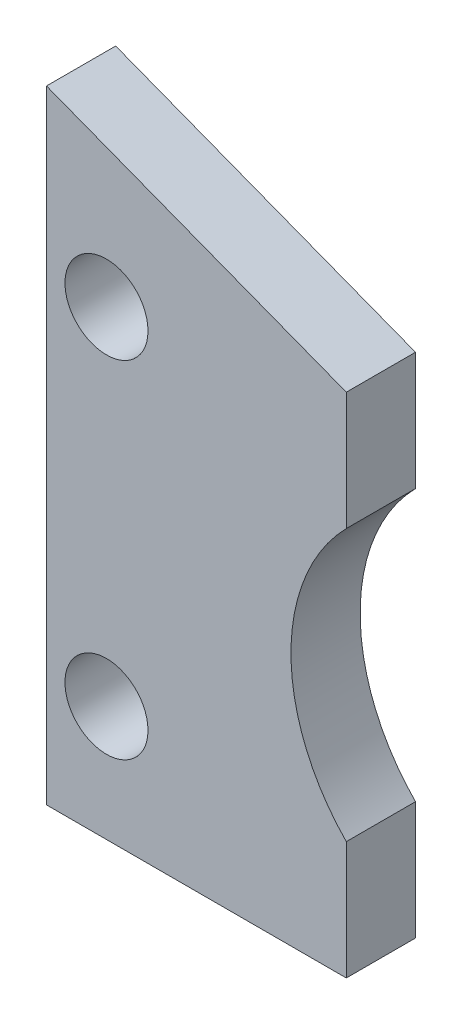
ISO-10303-21;
HEADER;
FILE_DESCRIPTION(('STEP AP214'),'2;1');
FILE_NAME('part.step','',(''),(''),'','','');
FILE_SCHEMA(('AUTOMOTIVE_DESIGN { 1 0 10303 214 1 1 1 1 }'));
ENDSEC;
DATA;
#1=APPLICATION_CONTEXT('core data for automotive mechanical design processes');
#2=APPLICATION_PROTOCOL_DEFINITION('international standard','automotive_design',2000,#1);
#3=PRODUCT_CONTEXT('',#1,'mechanical');
#4=PRODUCT('Part','Part','',(#3));
#5=PRODUCT_RELATED_PRODUCT_CATEGORY('part','',(#4));
#6=PRODUCT_DEFINITION_FORMATION('','',#4);
#7=PRODUCT_DEFINITION_CONTEXT('part definition',#1,'design');
#8=PRODUCT_DEFINITION('design','',#6,#7);
#9=PRODUCT_DEFINITION_SHAPE('','',#8);
#10=(LENGTH_UNIT() NAMED_UNIT(*) SI_UNIT(.MILLI.,.METRE.));
#11=(NAMED_UNIT(*) PLANE_ANGLE_UNIT() SI_UNIT($,.RADIAN.));
#12=(NAMED_UNIT(*) SI_UNIT($,.STERADIAN.) SOLID_ANGLE_UNIT());
#13=UNCERTAINTY_MEASURE_WITH_UNIT(LENGTH_MEASURE(1.E-05),#10,'distance_accuracy_value','');
#14=(GEOMETRIC_REPRESENTATION_CONTEXT(3) GLOBAL_UNCERTAINTY_ASSIGNED_CONTEXT((#13)) GLOBAL_UNIT_ASSIGNED_CONTEXT((#10,
#11,#12)) REPRESENTATION_CONTEXT('',''));
#15=CARTESIAN_POINT('',(0.,0.,0.));
#16=DIRECTION('',(0.,0.,1.));
#17=DIRECTION('',(1.,0.,0.));
#18=AXIS2_PLACEMENT_3D('',#15,#16,#17);
#19=CARTESIAN_POINT('',(0.,0.,7.5));
#20=DIRECTION('',(0.,1.,0.));
#21=DIRECTION('',(0.,0.,1.));
#22=AXIS2_PLACEMENT_3D('',#19,#20,#21);
#23=PLANE('',#22);
#24=DIRECTION('',(1.,0.,0.));
#25=VECTOR('',#24,1.);
#26=CARTESIAN_POINT('',(0.,0.,-7.5));
#27=LINE('',#26,#25);
#28=CARTESIAN_POINT('',(0.,0.,-7.5));
#29=VERTEX_POINT('',#28);
#30=CARTESIAN_POINT('',(65.,0.,-7.5));
#31=VERTEX_POINT('',#30);
#32=EDGE_CURVE('E118',#29,#31,#27,.T.);
#33=ORIENTED_EDGE('',*,*,#32,.T.);
#34=DIRECTION('',(0.,0.,-1.));
#35=VECTOR('',#34,1.);
#36=CARTESIAN_POINT('',(65.,0.,7.5));
#37=LINE('',#36,#35);
#38=CARTESIAN_POINT('',(65.,0.,7.5));
#39=VERTEX_POINT('',#38);
#40=EDGE_CURVE('E11',#39,#31,#37,.T.);
#41=ORIENTED_EDGE('',*,*,#40,.F.);
#42=DIRECTION('',(1.,0.,0.));
#43=VECTOR('',#42,1.);
#44=CARTESIAN_POINT('',(0.,0.,7.5));
#45=LINE('',#44,#43);
#46=CARTESIAN_POINT('',(0.,0.,7.5));
#47=VERTEX_POINT('',#46);
#48=EDGE_CURVE('E129',#47,#39,#45,.T.);
#49=ORIENTED_EDGE('',*,*,#48,.F.);
#50=DIRECTION('',(0.,0.,-1.));
#51=VECTOR('',#50,1.);
#52=CARTESIAN_POINT('',(0.,0.,7.5));
#53=LINE('',#52,#51);
#54=EDGE_CURVE('E114',#47,#29,#53,.T.);
#55=ORIENTED_EDGE('',*,*,#54,.T.);
#56=EDGE_LOOP('',(#33,#41,#49,#55));
#57=FACE_BOUND('',#56,.T.);
#58=ADVANCED_FACE('F34',(#57),#23,.F.);
#59=CARTESIAN_POINT('',(65.,0.,7.5));
#60=DIRECTION('',(-1.,0.,0.));
#61=DIRECTION('',(0.,-1.,0.));
#62=AXIS2_PLACEMENT_3D('',#59,#60,#61);
#63=PLANE('',#62);
#64=DIRECTION('',(0.,1.,0.));
#65=VECTOR('',#64,1.);
#66=CARTESIAN_POINT('',(65.,0.,-7.5));
#67=LINE('',#66,#65);
#68=CARTESIAN_POINT('',(65.,25.6061230866018,-7.5));
#69=VERTEX_POINT('',#68);
#70=EDGE_CURVE('E121',#31,#69,#67,.T.);
#71=ORIENTED_EDGE('',*,*,#70,.T.);
#72=DIRECTION('',(0.,0.,-1.));
#73=VECTOR('',#72,1.);
#74=CARTESIAN_POINT('',(65.,25.6061230866018,7.5));
#75=LINE('',#74,#73);
#76=CARTESIAN_POINT('',(65.,25.6061230866018,7.5));
#77=VERTEX_POINT('',#76);
#78=EDGE_CURVE('E42',#77,#69,#75,.T.);
#79=ORIENTED_EDGE('',*,*,#78,.F.);
#80=DIRECTION('',(0.,1.,0.));
#81=VECTOR('',#80,1.);
#82=CARTESIAN_POINT('',(65.,0.,7.5));
#83=LINE('',#82,#81);
#84=EDGE_CURVE('E87',#39,#77,#83,.T.);
#85=ORIENTED_EDGE('',*,*,#84,.F.);
#86=ORIENTED_EDGE('',*,*,#40,.T.);
#87=EDGE_LOOP('',(#71,#79,#85,#86));
#88=FACE_BOUND('',#87,.T.);
#89=ADVANCED_FACE('F154',(#88),#63,.F.);
#90=CARTESIAN_POINT('',(95.,55.,7.5));
#91=DIRECTION('',(0.,0.,-1.));
#92=DIRECTION('',(-1.,0.,0.));
#93=AXIS2_PLACEMENT_3D('',#90,#91,#92);
#94=CYLINDRICAL_SURFACE('',#93,42.);
#95=CARTESIAN_POINT('',(95.,55.,-7.5));
#96=DIRECTION('',(0.,0.,-1.));
#97=DIRECTION('',(-1.,0.,0.));
#98=AXIS2_PLACEMENT_3D('',#95,#96,#97);
#99=CIRCLE('',#98,42.);
#100=CARTESIAN_POINT('',(65.,84.3938769133982,-7.5));
#101=VERTEX_POINT('',#100);
#102=EDGE_CURVE('E124',#69,#101,#99,.T.);
#103=ORIENTED_EDGE('',*,*,#102,.T.);
#104=DIRECTION('',(0.,0.,-1.));
#105=VECTOR('',#104,1.);
#106=CARTESIAN_POINT('',(65.,84.3938769133982,7.5));
#107=LINE('',#106,#105);
#108=CARTESIAN_POINT('',(65.,84.3938769133982,7.5));
#109=VERTEX_POINT('',#108);
#110=EDGE_CURVE('E109',#109,#101,#107,.T.);
#111=ORIENTED_EDGE('',*,*,#110,.F.);
#112=CARTESIAN_POINT('',(95.,55.,7.5));
#113=DIRECTION('',(0.,0.,-1.));
#114=DIRECTION('',(-1.,0.,0.));
#115=AXIS2_PLACEMENT_3D('',#112,#113,#114);
#116=CIRCLE('',#115,42.);
#117=EDGE_CURVE('E100',#77,#109,#116,.T.);
#118=ORIENTED_EDGE('',*,*,#117,.F.);
#119=ORIENTED_EDGE('',*,*,#78,.T.);
#120=EDGE_LOOP('',(#103,#111,#118,#119));
#121=FACE_BOUND('',#120,.T.);
#122=ADVANCED_FACE('F135',(#121),#94,.F.);
#123=CARTESIAN_POINT('',(65.,110.,7.5));
#124=DIRECTION('',(-1.,0.,0.));
#125=DIRECTION('',(0.,-1.,0.));
#126=AXIS2_PLACEMENT_3D('',#123,#124,#125);
#127=PLANE('',#126);
#128=DIRECTION('',(0.,1.,0.));
#129=VECTOR('',#128,1.);
#130=CARTESIAN_POINT('',(65.,110.,-7.5));
#131=LINE('',#130,#129);
#132=CARTESIAN_POINT('',(65.,110.,-7.5));
#133=VERTEX_POINT('',#132);
#134=EDGE_CURVE('E108',#101,#133,#131,.T.);
#135=ORIENTED_EDGE('',*,*,#134,.T.);
#136=DIRECTION('',(0.,0.,-1.));
#137=VECTOR('',#136,1.);
#138=CARTESIAN_POINT('',(65.,110.,7.5));
#139=LINE('',#138,#137);
#140=CARTESIAN_POINT('',(65.,110.,7.5));
#141=VERTEX_POINT('',#140);
#142=EDGE_CURVE('E105',#141,#133,#139,.T.);
#143=ORIENTED_EDGE('',*,*,#142,.F.);
#144=DIRECTION('',(0.,1.,0.));
#145=VECTOR('',#144,1.);
#146=CARTESIAN_POINT('',(65.,110.,7.5));
#147=LINE('',#146,#145);
#148=EDGE_CURVE('E94',#109,#141,#147,.T.);
#149=ORIENTED_EDGE('',*,*,#148,.F.);
#150=ORIENTED_EDGE('',*,*,#110,.T.);
#151=EDGE_LOOP('',(#135,#143,#149,#150));
#152=FACE_BOUND('',#151,.T.);
#153=ADVANCED_FACE('F106',(#152),#127,.F.);
#154=CARTESIAN_POINT('',(0.,135.,7.5));
#155=DIRECTION('',(-0.358979079308869,-0.93334560620306,0.));
#156=DIRECTION('',(0.93334560620306,-0.358979079308869,0.));
#157=AXIS2_PLACEMENT_3D('',#154,#155,#156);
#158=PLANE('',#157);
#159=DIRECTION('',(-0.93334560620306,0.358979079308869,0.));
#160=VECTOR('',#159,1.);
#161=CARTESIAN_POINT('',(0.,135.,-7.5));
#162=LINE('',#161,#160);
#163=CARTESIAN_POINT('',(0.,135.,-7.5));
#164=VERTEX_POINT('',#163);
#165=EDGE_CURVE('E73',#133,#164,#162,.T.);
#166=ORIENTED_EDGE('',*,*,#165,.T.);
#167=DIRECTION('',(0.,0.,-1.));
#168=VECTOR('',#167,1.);
#169=CARTESIAN_POINT('',(0.,135.,7.5));
#170=LINE('',#169,#168);
#171=CARTESIAN_POINT('',(0.,135.,7.5));
#172=VERTEX_POINT('',#171);
#173=EDGE_CURVE('E110',#172,#164,#170,.T.);
#174=ORIENTED_EDGE('',*,*,#173,.F.);
#175=DIRECTION('',(-0.93334560620306,0.358979079308869,0.));
#176=VECTOR('',#175,1.);
#177=CARTESIAN_POINT('',(0.,135.,7.5));
#178=LINE('',#177,#176);
#179=EDGE_CURVE('E98',#141,#172,#178,.T.);
#180=ORIENTED_EDGE('',*,*,#179,.F.);
#181=ORIENTED_EDGE('',*,*,#142,.T.);
#182=EDGE_LOOP('',(#166,#174,#180,#181));
#183=FACE_BOUND('',#182,.T.);
#184=ADVANCED_FACE('F112',(#183),#158,.F.);
#185=CARTESIAN_POINT('',(0.,0.,7.5));
#186=DIRECTION('',(1.,0.,0.));
#187=DIRECTION('',(0.,0.,-1.));
#188=AXIS2_PLACEMENT_3D('',#185,#186,#187);
#189=PLANE('',#188);
#190=DIRECTION('',(0.,-1.,0.));
#191=VECTOR('',#190,1.);
#192=CARTESIAN_POINT('',(0.,0.,-7.5));
#193=LINE('',#192,#191);
#194=EDGE_CURVE('E79',#164,#29,#193,.T.);
#195=ORIENTED_EDGE('',*,*,#194,.T.);
#196=ORIENTED_EDGE('',*,*,#54,.F.);
#197=DIRECTION('',(0.,-1.,0.));
#198=VECTOR('',#197,1.);
#199=CARTESIAN_POINT('',(0.,0.,7.5));
#200=LINE('',#199,#198);
#201=EDGE_CURVE('E50',#172,#47,#200,.T.);
#202=ORIENTED_EDGE('',*,*,#201,.F.);
#203=ORIENTED_EDGE('',*,*,#173,.T.);
#204=EDGE_LOOP('',(#195,#196,#202,#203));
#205=FACE_BOUND('',#204,.T.);
#206=ADVANCED_FACE('F142',(#205),#189,.F.);
#207=CARTESIAN_POINT('',(95.,55.,7.5));
#208=DIRECTION('',(0.,0.,-1.));
#209=DIRECTION('',(-1.,0.,0.));
#210=AXIS2_PLACEMENT_3D('',#207,#208,#209);
#211=PLANE('',#210);
#212=CARTESIAN_POINT('',(13.,100.,7.5));
#213=DIRECTION('',(0.,0.,1.));
#214=DIRECTION('',(1.,0.,0.));
#215=AXIS2_PLACEMENT_3D('',#212,#213,#214);
#216=CIRCLE('',#215,9.00000000000001);
#217=CARTESIAN_POINT('',(22.,100.,7.5));
#218=VERTEX_POINT('',#217);
#219=EDGE_CURVE('E219',#218,#218,#216,.T.);
#220=ORIENTED_EDGE('',*,*,#219,.F.);
#221=EDGE_LOOP('',(#220));
#222=FACE_BOUND('',#221,.T.);
#223=CARTESIAN_POINT('',(13.0000000000001,25.,7.5));
#224=DIRECTION('',(0.,0.,1.));
#225=DIRECTION('',(1.,0.,0.));
#226=AXIS2_PLACEMENT_3D('',#223,#224,#225);
#227=CIRCLE('',#226,9.);
#228=CARTESIAN_POINT('',(22.0000000000001,25.,7.5));
#229=VERTEX_POINT('',#228);
#230=EDGE_CURVE('E224',#229,#229,#227,.T.);
#231=ORIENTED_EDGE('',*,*,#230,.F.);
#232=EDGE_LOOP('',(#231));
#233=FACE_BOUND('',#232,.T.);
#234=ORIENTED_EDGE('',*,*,#48,.T.);
#235=ORIENTED_EDGE('',*,*,#84,.T.);
#236=ORIENTED_EDGE('',*,*,#117,.T.);
#237=ORIENTED_EDGE('',*,*,#148,.T.);
#238=ORIENTED_EDGE('',*,*,#179,.T.);
#239=ORIENTED_EDGE('',*,*,#201,.T.);
#240=EDGE_LOOP('',(#234,#235,#236,#237,#238,#239));
#241=FACE_BOUND('',#240,.T.);
#242=ADVANCED_FACE('F96',(#222,#233,#241),#211,.F.);
#243=CARTESIAN_POINT('',(95.,55.,-7.5));
#244=DIRECTION('',(0.,0.,-1.));
#245=DIRECTION('',(-1.,0.,0.));
#246=AXIS2_PLACEMENT_3D('',#243,#244,#245);
#247=PLANE('',#246);
#248=CARTESIAN_POINT('',(13.,100.,-7.5));
#249=DIRECTION('',(0.,0.,1.));
#250=DIRECTION('',(1.,0.,0.));
#251=AXIS2_PLACEMENT_3D('',#248,#249,#250);
#252=CIRCLE('',#251,9.00000000000001);
#253=CARTESIAN_POINT('',(22.,100.,-7.5));
#254=VERTEX_POINT('',#253);
#255=EDGE_CURVE('E122',#254,#254,#252,.T.);
#256=ORIENTED_EDGE('',*,*,#255,.T.);
#257=EDGE_LOOP('',(#256));
#258=FACE_BOUND('',#257,.T.);
#259=CARTESIAN_POINT('',(13.0000000000001,25.,-7.5));
#260=DIRECTION('',(0.,0.,1.));
#261=DIRECTION('',(1.,0.,0.));
#262=AXIS2_PLACEMENT_3D('',#259,#260,#261);
#263=CIRCLE('',#262,9.);
#264=CARTESIAN_POINT('',(22.0000000000001,25.,-7.5));
#265=VERTEX_POINT('',#264);
#266=EDGE_CURVE('E220',#265,#265,#263,.T.);
#267=ORIENTED_EDGE('',*,*,#266,.T.);
#268=EDGE_LOOP('',(#267));
#269=FACE_BOUND('',#268,.T.);
#270=ORIENTED_EDGE('',*,*,#32,.F.);
#271=ORIENTED_EDGE('',*,*,#194,.F.);
#272=ORIENTED_EDGE('',*,*,#165,.F.);
#273=ORIENTED_EDGE('',*,*,#134,.F.);
#274=ORIENTED_EDGE('',*,*,#102,.F.);
#275=ORIENTED_EDGE('',*,*,#70,.F.);
#276=EDGE_LOOP('',(#270,#271,#272,#273,#274,#275));
#277=FACE_BOUND('',#276,.T.);
#278=ADVANCED_FACE('F138',(#258,#269,#277),#247,.T.);
#279=CARTESIAN_POINT('',(13.0000000000001,25.,-7.5));
#280=DIRECTION('',(0.,0.,1.));
#281=DIRECTION('',(1.,0.,0.));
#282=AXIS2_PLACEMENT_3D('',#279,#280,#281);
#283=CYLINDRICAL_SURFACE('',#282,9.);
#284=ORIENTED_EDGE('',*,*,#266,.F.);
#285=EDGE_LOOP('',(#284));
#286=FACE_BOUND('',#285,.T.);
#287=ORIENTED_EDGE('',*,*,#230,.T.);
#288=EDGE_LOOP('',(#287));
#289=FACE_BOUND('',#288,.T.);
#290=ADVANCED_FACE('F191',(#286,#289),#283,.F.);
#291=CARTESIAN_POINT('',(13.,100.,-7.5));
#292=DIRECTION('',(0.,0.,1.));
#293=DIRECTION('',(1.,0.,0.));
#294=AXIS2_PLACEMENT_3D('',#291,#292,#293);
#295=CYLINDRICAL_SURFACE('',#294,9.00000000000001);
#296=ORIENTED_EDGE('',*,*,#255,.F.);
#297=EDGE_LOOP('',(#296));
#298=FACE_BOUND('',#297,.T.);
#299=ORIENTED_EDGE('',*,*,#219,.T.);
#300=EDGE_LOOP('',(#299));
#301=FACE_BOUND('',#300,.T.);
#302=ADVANCED_FACE('F200',(#298,#301),#295,.F.);
#303=CLOSED_SHELL('',(#58,#89,#122,#153,#184,#206,#242,#278,#290,#302));
#304=MANIFOLD_SOLID_BREP('B2',#303);
#305=ADVANCED_BREP_SHAPE_REPRESENTATION('',(#18,#304),#14);
#306=SHAPE_DEFINITION_REPRESENTATION(#9,#305);
ENDSEC;
END-ISO-10303-21;
